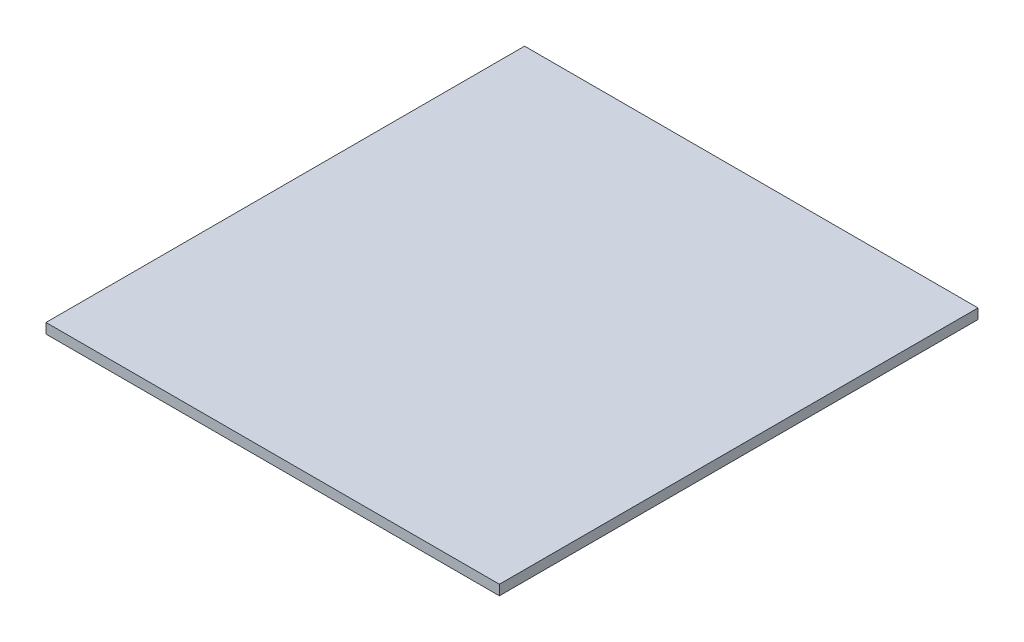
ISO-10303-21;
HEADER;
FILE_DESCRIPTION(('STEP AP214'),'2;1');
FILE_NAME('part.step','',(''),(''),'','','');
FILE_SCHEMA(('AUTOMOTIVE_DESIGN { 1 0 10303 214 1 1 1 1 }'));
ENDSEC;
DATA;
#1=APPLICATION_CONTEXT('core data for automotive mechanical design processes');
#2=APPLICATION_PROTOCOL_DEFINITION('international standard','automotive_design',2000,#1);
#3=PRODUCT_CONTEXT('',#1,'mechanical');
#4=PRODUCT('Part','Part','',(#3));
#5=PRODUCT_RELATED_PRODUCT_CATEGORY('part','',(#4));
#6=PRODUCT_DEFINITION_FORMATION('','',#4);
#7=PRODUCT_DEFINITION_CONTEXT('part definition',#1,'design');
#8=PRODUCT_DEFINITION('design','',#6,#7);
#9=PRODUCT_DEFINITION_SHAPE('','',#8);
#10=(LENGTH_UNIT() NAMED_UNIT(*) SI_UNIT(.MILLI.,.METRE.));
#11=(NAMED_UNIT(*) PLANE_ANGLE_UNIT() SI_UNIT($,.RADIAN.));
#12=(NAMED_UNIT(*) SI_UNIT($,.STERADIAN.) SOLID_ANGLE_UNIT());
#13=UNCERTAINTY_MEASURE_WITH_UNIT(LENGTH_MEASURE(1.E-05),#10,'distance_accuracy_value','');
#14=(GEOMETRIC_REPRESENTATION_CONTEXT(3) GLOBAL_UNCERTAINTY_ASSIGNED_CONTEXT((#13)) GLOBAL_UNIT_ASSIGNED_CONTEXT((#10,
#11,#12)) REPRESENTATION_CONTEXT('',''));
#15=CARTESIAN_POINT('',(0.,0.,0.));
#16=DIRECTION('',(0.,0.,1.));
#17=DIRECTION('',(1.,0.,0.));
#18=AXIS2_PLACEMENT_3D('',#15,#16,#17);
#19=CARTESIAN_POINT('',(0.,4.,190.));
#20=DIRECTION('',(1.,0.,0.));
#21=DIRECTION('',(0.,0.,-1.));
#22=AXIS2_PLACEMENT_3D('',#19,#20,#21);
#23=PLANE('',#22);
#24=DIRECTION('',(0.,-1.,0.));
#25=VECTOR('',#24,1.);
#26=CARTESIAN_POINT('',(0.,4.,0.));
#27=LINE('',#26,#25);
#28=CARTESIAN_POINT('',(0.,4.,0.));
#29=VERTEX_POINT('',#28);
#30=CARTESIAN_POINT('',(0.,0.,0.));
#31=VERTEX_POINT('',#30);
#32=EDGE_CURVE('E111',#29,#31,#27,.T.);
#33=ORIENTED_EDGE('',*,*,#32,.T.);
#34=DIRECTION('',(0.,0.,-1.));
#35=VECTOR('',#34,1.);
#36=CARTESIAN_POINT('',(0.,0.,190.));
#37=LINE('',#36,#35);
#38=CARTESIAN_POINT('',(0.,0.,190.));
#39=VERTEX_POINT('',#38);
#40=EDGE_CURVE('E11',#39,#31,#37,.T.);
#41=ORIENTED_EDGE('',*,*,#40,.F.);
#42=DIRECTION('',(0.,-1.,0.));
#43=VECTOR('',#42,1.);
#44=CARTESIAN_POINT('',(0.,4.,190.));
#45=LINE('',#44,#43);
#46=CARTESIAN_POINT('',(0.,4.,190.));
#47=VERTEX_POINT('',#46);
#48=EDGE_CURVE('E94',#47,#39,#45,.T.);
#49=ORIENTED_EDGE('',*,*,#48,.F.);
#50=DIRECTION('',(0.,0.,-1.));
#51=VECTOR('',#50,1.);
#52=CARTESIAN_POINT('',(0.,4.,190.));
#53=LINE('',#52,#51);
#54=EDGE_CURVE('E107',#47,#29,#53,.T.);
#55=ORIENTED_EDGE('',*,*,#54,.T.);
#56=EDGE_LOOP('',(#33,#41,#49,#55));
#57=FACE_BOUND('',#56,.T.);
#58=ADVANCED_FACE('F42',(#57),#23,.F.);
#59=CARTESIAN_POINT('',(0.,0.,190.));
#60=DIRECTION('',(0.,1.,0.));
#61=DIRECTION('',(0.,0.,1.));
#62=AXIS2_PLACEMENT_3D('',#59,#60,#61);
#63=PLANE('',#62);
#64=DIRECTION('',(1.,0.,0.));
#65=VECTOR('',#64,1.);
#66=CARTESIAN_POINT('',(0.,0.,0.));
#67=LINE('',#66,#65);
#68=CARTESIAN_POINT('',(180.,0.,0.));
#69=VERTEX_POINT('',#68);
#70=EDGE_CURVE('E99',#31,#69,#67,.T.);
#71=ORIENTED_EDGE('',*,*,#70,.T.);
#72=DIRECTION('',(0.,0.,-1.));
#73=VECTOR('',#72,1.);
#74=CARTESIAN_POINT('',(180.,0.,190.));
#75=LINE('',#74,#73);
#76=CARTESIAN_POINT('',(180.,0.,190.));
#77=VERTEX_POINT('',#76);
#78=EDGE_CURVE('E51',#77,#69,#75,.T.);
#79=ORIENTED_EDGE('',*,*,#78,.F.);
#80=DIRECTION('',(1.,0.,0.));
#81=VECTOR('',#80,1.);
#82=CARTESIAN_POINT('',(0.,0.,190.));
#83=LINE('',#82,#81);
#84=EDGE_CURVE('E89',#39,#77,#83,.T.);
#85=ORIENTED_EDGE('',*,*,#84,.F.);
#86=ORIENTED_EDGE('',*,*,#40,.T.);
#87=EDGE_LOOP('',(#71,#79,#85,#86));
#88=FACE_BOUND('',#87,.T.);
#89=ADVANCED_FACE('F98',(#88),#63,.F.);
#90=CARTESIAN_POINT('',(180.,4.,190.));
#91=DIRECTION('',(-1.,0.,0.));
#92=DIRECTION('',(0.,0.,1.));
#93=AXIS2_PLACEMENT_3D('',#90,#91,#92);
#94=PLANE('',#93);
#95=DIRECTION('',(0.,1.,0.));
#96=VECTOR('',#95,1.);
#97=CARTESIAN_POINT('',(180.,4.,0.));
#98=LINE('',#97,#96);
#99=CARTESIAN_POINT('',(180.,4.,0.));
#100=VERTEX_POINT('',#99);
#101=EDGE_CURVE('E76',#69,#100,#98,.T.);
#102=ORIENTED_EDGE('',*,*,#101,.T.);
#103=DIRECTION('',(0.,0.,-1.));
#104=VECTOR('',#103,1.);
#105=CARTESIAN_POINT('',(180.,4.,190.));
#106=LINE('',#105,#104);
#107=CARTESIAN_POINT('',(180.,4.,190.));
#108=VERTEX_POINT('',#107);
#109=EDGE_CURVE('E101',#108,#100,#106,.T.);
#110=ORIENTED_EDGE('',*,*,#109,.F.);
#111=DIRECTION('',(0.,1.,0.));
#112=VECTOR('',#111,1.);
#113=CARTESIAN_POINT('',(180.,4.,190.));
#114=LINE('',#113,#112);
#115=EDGE_CURVE('E92',#77,#108,#114,.T.);
#116=ORIENTED_EDGE('',*,*,#115,.F.);
#117=ORIENTED_EDGE('',*,*,#78,.T.);
#118=EDGE_LOOP('',(#102,#110,#116,#117));
#119=FACE_BOUND('',#118,.T.);
#120=ADVANCED_FACE('F102',(#119),#94,.F.);
#121=CARTESIAN_POINT('',(0.,4.,190.));
#122=DIRECTION('',(0.,-1.,0.));
#123=DIRECTION('',(0.,0.,-1.));
#124=AXIS2_PLACEMENT_3D('',#121,#122,#123);
#125=PLANE('',#124);
#126=DIRECTION('',(-1.,0.,0.));
#127=VECTOR('',#126,1.);
#128=CARTESIAN_POINT('',(0.,4.,0.));
#129=LINE('',#128,#127);
#130=EDGE_CURVE('E82',#100,#29,#129,.T.);
#131=ORIENTED_EDGE('',*,*,#130,.T.);
#132=ORIENTED_EDGE('',*,*,#54,.F.);
#133=DIRECTION('',(-1.,0.,0.));
#134=VECTOR('',#133,1.);
#135=CARTESIAN_POINT('',(0.,4.,190.));
#136=LINE('',#135,#134);
#137=EDGE_CURVE('E59',#108,#47,#136,.T.);
#138=ORIENTED_EDGE('',*,*,#137,.F.);
#139=ORIENTED_EDGE('',*,*,#109,.T.);
#140=EDGE_LOOP('',(#131,#132,#138,#139));
#141=FACE_BOUND('',#140,.T.);
#142=ADVANCED_FACE('F125',(#141),#125,.F.);
#143=CARTESIAN_POINT('',(0.,0.,190.));
#144=DIRECTION('',(0.,0.,1.));
#145=DIRECTION('',(1.,0.,0.));
#146=AXIS2_PLACEMENT_3D('',#143,#144,#145);
#147=PLANE('',#146);
#148=ORIENTED_EDGE('',*,*,#48,.T.);
#149=ORIENTED_EDGE('',*,*,#84,.T.);
#150=ORIENTED_EDGE('',*,*,#115,.T.);
#151=ORIENTED_EDGE('',*,*,#137,.T.);
#152=EDGE_LOOP('',(#148,#149,#150,#151));
#153=FACE_BOUND('',#152,.T.);
#154=ADVANCED_FACE('F90',(#153),#147,.T.);
#155=CARTESIAN_POINT('',(0.,0.,0.));
#156=DIRECTION('',(0.,0.,1.));
#157=DIRECTION('',(1.,0.,0.));
#158=AXIS2_PLACEMENT_3D('',#155,#156,#157);
#159=PLANE('',#158);
#160=ORIENTED_EDGE('',*,*,#32,.F.);
#161=ORIENTED_EDGE('',*,*,#130,.F.);
#162=ORIENTED_EDGE('',*,*,#101,.F.);
#163=ORIENTED_EDGE('',*,*,#70,.F.);
#164=EDGE_LOOP('',(#160,#161,#162,#163));
#165=FACE_BOUND('',#164,.T.);
#166=ADVANCED_FACE('F128',(#165),#159,.F.);
#167=CLOSED_SHELL('',(#58,#89,#120,#142,#154,#166));
#168=MANIFOLD_SOLID_BREP('B2',#167);
#169=ADVANCED_BREP_SHAPE_REPRESENTATION('',(#18,#168),#14);
#170=SHAPE_DEFINITION_REPRESENTATION(#9,#169);
ENDSEC;
END-ISO-10303-21;
